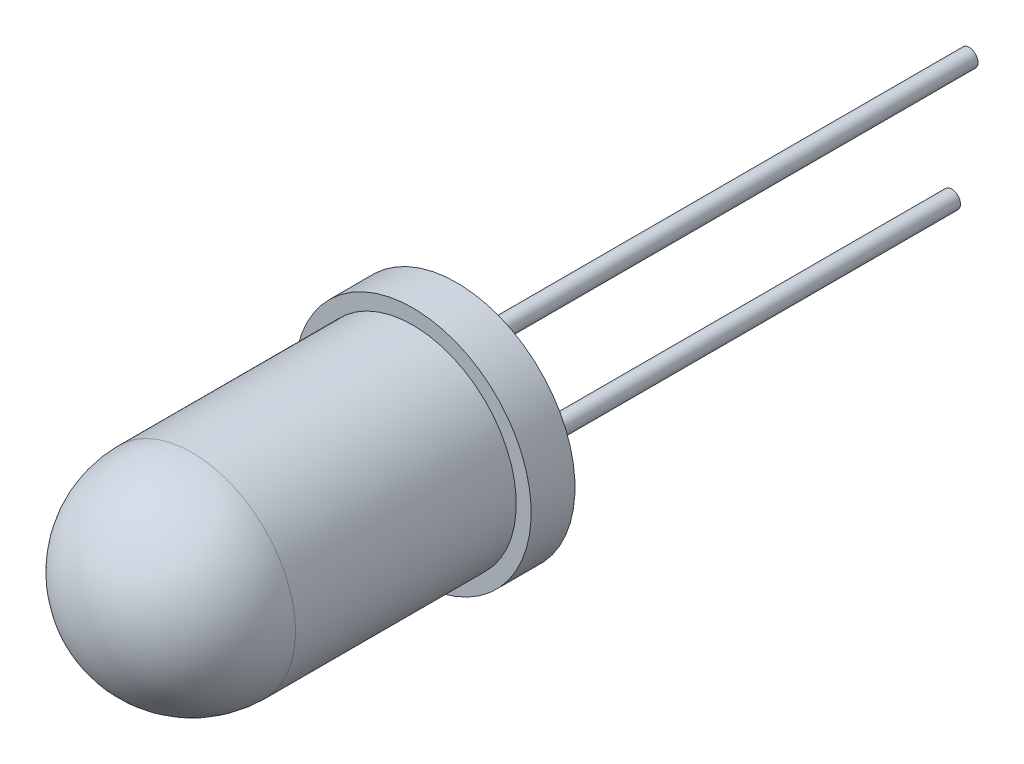
ISO-10303-21;
HEADER;
FILE_DESCRIPTION(('STEP AP214'),'2;1');
FILE_NAME('part.step','',(''),(''),'','','');
FILE_SCHEMA(('AUTOMOTIVE_DESIGN { 1 0 10303 214 1 1 1 1 }'));
ENDSEC;
DATA;
#1=APPLICATION_CONTEXT('core data for automotive mechanical design processes');
#2=APPLICATION_PROTOCOL_DEFINITION('international standard','automotive_design',2000,#1);
#3=PRODUCT_CONTEXT('',#1,'mechanical');
#4=PRODUCT('Part','Part','',(#3));
#5=PRODUCT_RELATED_PRODUCT_CATEGORY('part','',(#4));
#6=PRODUCT_DEFINITION_FORMATION('','',#4);
#7=PRODUCT_DEFINITION_CONTEXT('part definition',#1,'design');
#8=PRODUCT_DEFINITION('design','',#6,#7);
#9=PRODUCT_DEFINITION_SHAPE('','',#8);
#10=(LENGTH_UNIT() NAMED_UNIT(*) SI_UNIT(.MILLI.,.METRE.));
#11=(NAMED_UNIT(*) PLANE_ANGLE_UNIT() SI_UNIT($,.RADIAN.));
#12=(NAMED_UNIT(*) SI_UNIT($,.STERADIAN.) SOLID_ANGLE_UNIT());
#13=UNCERTAINTY_MEASURE_WITH_UNIT(LENGTH_MEASURE(1.E-05),#10,'distance_accuracy_value','');
#14=(GEOMETRIC_REPRESENTATION_CONTEXT(3) GLOBAL_UNCERTAINTY_ASSIGNED_CONTEXT((#13)) GLOBAL_UNIT_ASSIGNED_CONTEXT((#10,
#11,#12)) REPRESENTATION_CONTEXT('',''));
#15=CARTESIAN_POINT('',(0.,0.,0.));
#16=DIRECTION('',(0.,0.,1.));
#17=DIRECTION('',(1.,0.,0.));
#18=AXIS2_PLACEMENT_3D('',#15,#16,#17);
#19=CARTESIAN_POINT('',(0.,0.,6.04));
#20=DIRECTION('',(0.,0.,-1.));
#21=DIRECTION('',(-1.,0.,0.));
#22=AXIS2_PLACEMENT_3D('',#19,#20,#21);
#23=SPHERICAL_SURFACE('',#22,2.36);
#24=CARTESIAN_POINT('',(0.,0.,6.04));
#25=DIRECTION('',(0.,0.,-1.));
#26=DIRECTION('',(-1.,0.,0.));
#27=AXIS2_PLACEMENT_3D('',#24,#25,#26);
#28=CIRCLE('',#27,2.36);
#29=CARTESIAN_POINT('',(-2.36,0.,6.04));
#30=VERTEX_POINT('',#29);
#31=EDGE_CURVE('E43',#30,#30,#28,.T.);
#32=ORIENTED_EDGE('',*,*,#31,.F.);
#33=EDGE_LOOP('',(#32));
#34=FACE_BOUND('',#33,.T.);
#35=ADVANCED_FACE('F33',(#34),#23,.T.);
#36=CARTESIAN_POINT('',(0.,0.,0.));
#37=DIRECTION('',(0.,0.,-1.));
#38=DIRECTION('',(-1.,0.,0.));
#39=AXIS2_PLACEMENT_3D('',#36,#37,#38);
#40=CYLINDRICAL_SURFACE('',#39,2.36);
#41=CARTESIAN_POINT('',(0.,0.,1.));
#42=DIRECTION('',(0.,0.,-1.));
#43=DIRECTION('',(-1.,0.,0.));
#44=AXIS2_PLACEMENT_3D('',#41,#42,#43);
#45=CIRCLE('',#44,2.36);
#46=CARTESIAN_POINT('',(-2.36,0.,1.));
#47=VERTEX_POINT('',#46);
#48=EDGE_CURVE('E47',#47,#47,#45,.T.);
#49=ORIENTED_EDGE('',*,*,#48,.F.);
#50=EDGE_LOOP('',(#49));
#51=FACE_BOUND('',#50,.T.);
#52=ORIENTED_EDGE('',*,*,#31,.T.);
#53=EDGE_LOOP('',(#52));
#54=FACE_BOUND('',#53,.T.);
#55=ADVANCED_FACE('F83',(#51,#54),#40,.T.);
#56=CARTESIAN_POINT('',(2.36,0.,1.));
#57=DIRECTION('',(0.,0.,-1.));
#58=DIRECTION('',(-1.,0.,0.));
#59=AXIS2_PLACEMENT_3D('',#56,#57,#58);
#60=PLANE('',#59);
#61=CARTESIAN_POINT('',(0.,0.,1.));
#62=DIRECTION('',(0.,0.,-1.));
#63=DIRECTION('',(-1.,0.,0.));
#64=AXIS2_PLACEMENT_3D('',#61,#62,#63);
#65=CIRCLE('',#64,2.7);
#66=CARTESIAN_POINT('',(-2.7,0.,1.));
#67=VERTEX_POINT('',#66);
#68=EDGE_CURVE('E52',#67,#67,#65,.T.);
#69=ORIENTED_EDGE('',*,*,#68,.F.);
#70=EDGE_LOOP('',(#69));
#71=FACE_BOUND('',#70,.T.);
#72=ORIENTED_EDGE('',*,*,#48,.T.);
#73=EDGE_LOOP('',(#72));
#74=FACE_BOUND('',#73,.T.);
#75=ADVANCED_FACE('F88',(#71,#74),#60,.F.);
#76=CARTESIAN_POINT('',(0.,0.,0.));
#77=DIRECTION('',(0.,0.,-1.));
#78=DIRECTION('',(-1.,0.,0.));
#79=AXIS2_PLACEMENT_3D('',#76,#77,#78);
#80=CYLINDRICAL_SURFACE('',#79,2.7);
#81=CARTESIAN_POINT('',(0.,0.,0.));
#82=DIRECTION('',(0.,0.,-1.));
#83=DIRECTION('',(-1.,0.,0.));
#84=AXIS2_PLACEMENT_3D('',#81,#82,#83);
#85=CIRCLE('',#84,2.7);
#86=CARTESIAN_POINT('',(-2.7,0.,0.));
#87=VERTEX_POINT('',#86);
#88=EDGE_CURVE('E55',#87,#87,#85,.T.);
#89=ORIENTED_EDGE('',*,*,#88,.F.);
#90=EDGE_LOOP('',(#89));
#91=FACE_BOUND('',#90,.T.);
#92=ORIENTED_EDGE('',*,*,#68,.T.);
#93=EDGE_LOOP('',(#92));
#94=FACE_BOUND('',#93,.T.);
#95=ADVANCED_FACE('F79',(#91,#94),#80,.T.);
#96=CARTESIAN_POINT('',(2.7,0.,0.));
#97=DIRECTION('',(0.,0.,1.));
#98=DIRECTION('',(1.,0.,0.));
#99=AXIS2_PLACEMENT_3D('',#96,#97,#98);
#100=PLANE('',#99);
#101=CARTESIAN_POINT('',(1.3,0.,0.));
#102=DIRECTION('',(0.,0.,1.));
#103=DIRECTION('',(1.,0.,0.));
#104=AXIS2_PLACEMENT_3D('',#101,#102,#103);
#105=CIRCLE('',#104,0.2);
#106=CARTESIAN_POINT('',(1.5,0.,0.));
#107=VERTEX_POINT('',#106);
#108=EDGE_CURVE('E10',#107,#107,#105,.F.);
#109=ORIENTED_EDGE('',*,*,#108,.F.);
#110=EDGE_LOOP('',(#109));
#111=FACE_BOUND('',#110,.T.);
#112=CARTESIAN_POINT('',(-1.3,0.,0.));
#113=DIRECTION('',(0.,0.,1.));
#114=DIRECTION('',(1.,0.,0.));
#115=AXIS2_PLACEMENT_3D('',#112,#113,#114);
#116=CIRCLE('',#115,0.2);
#117=CARTESIAN_POINT('',(-1.1,0.,0.));
#118=VERTEX_POINT('',#117);
#119=EDGE_CURVE('E39',#118,#118,#116,.F.);
#120=ORIENTED_EDGE('',*,*,#119,.F.);
#121=EDGE_LOOP('',(#120));
#122=FACE_BOUND('',#121,.T.);
#123=ORIENTED_EDGE('',*,*,#88,.T.);
#124=EDGE_LOOP('',(#123));
#125=FACE_BOUND('',#124,.T.);
#126=ADVANCED_FACE('F70',(#111,#122,#125),#100,.F.);
#127=CARTESIAN_POINT('',(-1.3,0.,-10.));
#128=DIRECTION('',(0.,0.,1.));
#129=DIRECTION('',(1.,0.,0.));
#130=AXIS2_PLACEMENT_3D('',#127,#128,#129);
#131=CYLINDRICAL_SURFACE('',#130,0.2);
#132=ORIENTED_EDGE('',*,*,#119,.T.);
#133=EDGE_LOOP('',(#132));
#134=FACE_BOUND('',#133,.T.);
#135=CARTESIAN_POINT('',(-1.3,0.,-13.));
#136=DIRECTION('',(0.,0.,-1.));
#137=DIRECTION('',(-1.,0.,0.));
#138=AXIS2_PLACEMENT_3D('',#135,#136,#137);
#139=CIRCLE('',#138,0.2);
#140=CARTESIAN_POINT('',(-1.5,0.,-13.));
#141=VERTEX_POINT('',#140);
#142=EDGE_CURVE('E61',#141,#141,#139,.T.);
#143=ORIENTED_EDGE('',*,*,#142,.F.);
#144=EDGE_LOOP('',(#143));
#145=FACE_BOUND('',#144,.T.);
#146=ADVANCED_FACE('F67',(#134,#145),#131,.T.);
#147=CARTESIAN_POINT('',(1.3,0.,-10.));
#148=DIRECTION('',(0.,0.,1.));
#149=DIRECTION('',(1.,0.,0.));
#150=AXIS2_PLACEMENT_3D('',#147,#148,#149);
#151=CYLINDRICAL_SURFACE('',#150,0.2);
#152=CARTESIAN_POINT('',(1.3,0.,-10.));
#153=DIRECTION('',(0.,0.,-1.));
#154=DIRECTION('',(-1.,0.,0.));
#155=AXIS2_PLACEMENT_3D('',#152,#153,#154);
#156=CIRCLE('',#155,0.2);
#157=CARTESIAN_POINT('',(1.1,0.,-10.));
#158=VERTEX_POINT('',#157);
#159=EDGE_CURVE('E58',#158,#158,#156,.T.);
#160=ORIENTED_EDGE('',*,*,#159,.F.);
#161=EDGE_LOOP('',(#160));
#162=FACE_BOUND('',#161,.T.);
#163=ORIENTED_EDGE('',*,*,#108,.T.);
#164=EDGE_LOOP('',(#163));
#165=FACE_BOUND('',#164,.T.);
#166=ADVANCED_FACE('F69',(#162,#165),#151,.T.);
#167=CARTESIAN_POINT('',(1.3,0.,-10.));
#168=DIRECTION('',(0.,0.,-1.));
#169=DIRECTION('',(-1.,0.,0.));
#170=AXIS2_PLACEMENT_3D('',#167,#168,#169);
#171=PLANE('',#170);
#172=ORIENTED_EDGE('',*,*,#159,.T.);
#173=EDGE_LOOP('',(#172));
#174=FACE_BOUND('',#173,.T.);
#175=ADVANCED_FACE('F76',(#174),#171,.T.);
#176=CARTESIAN_POINT('',(-1.3,0.,-13.));
#177=DIRECTION('',(0.,0.,-1.));
#178=DIRECTION('',(-1.,0.,0.));
#179=AXIS2_PLACEMENT_3D('',#176,#177,#178);
#180=PLANE('',#179);
#181=ORIENTED_EDGE('',*,*,#142,.T.);
#182=EDGE_LOOP('',(#181));
#183=FACE_BOUND('',#182,.T.);
#184=ADVANCED_FACE('F65',(#183),#180,.T.);
#185=CLOSED_SHELL('',(#35,#55,#75,#95,#126,#146,#166,#175,#184));
#186=MANIFOLD_SOLID_BREP('B2',#185);
#187=ADVANCED_BREP_SHAPE_REPRESENTATION('',(#18,#186),#14);
#188=SHAPE_DEFINITION_REPRESENTATION(#9,#187);
ENDSEC;
END-ISO-10303-21;
